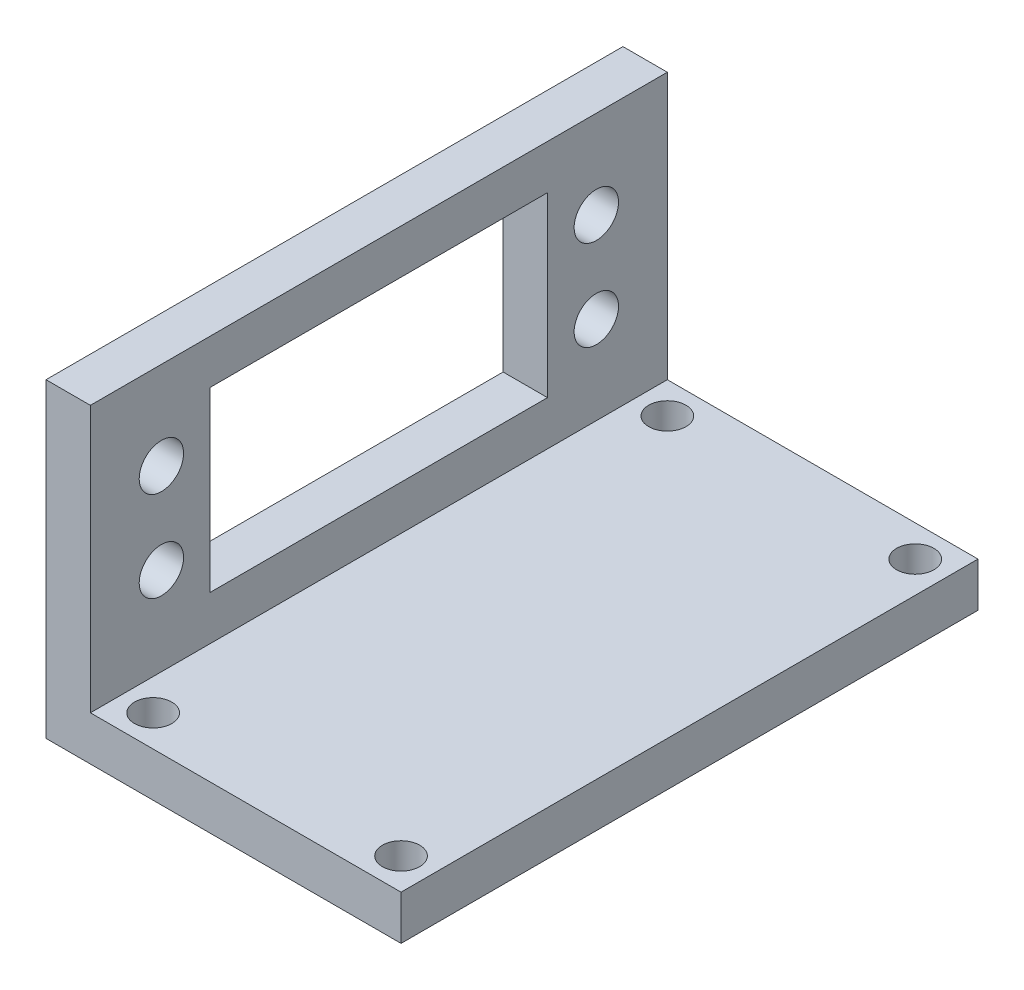
ISO-10303-21;
HEADER;
FILE_DESCRIPTION(('STEP AP214'),'2;1');
FILE_NAME('part.step','',(''),(''),'','','');
FILE_SCHEMA(('AUTOMOTIVE_DESIGN { 1 0 10303 214 1 1 1 1 }'));
ENDSEC;
DATA;
#1=APPLICATION_CONTEXT('core data for automotive mechanical design processes');
#2=APPLICATION_PROTOCOL_DEFINITION('international standard','automotive_design',2000,#1);
#3=PRODUCT_CONTEXT('',#1,'mechanical');
#4=PRODUCT('Part','Part','',(#3));
#5=PRODUCT_RELATED_PRODUCT_CATEGORY('part','',(#4));
#6=PRODUCT_DEFINITION_FORMATION('','',#4);
#7=PRODUCT_DEFINITION_CONTEXT('part definition',#1,'design');
#8=PRODUCT_DEFINITION('design','',#6,#7);
#9=PRODUCT_DEFINITION_SHAPE('','',#8);
#10=(LENGTH_UNIT() NAMED_UNIT(*) SI_UNIT(.MILLI.,.METRE.));
#11=(NAMED_UNIT(*) PLANE_ANGLE_UNIT() SI_UNIT($,.RADIAN.));
#12=(NAMED_UNIT(*) SI_UNIT($,.STERADIAN.) SOLID_ANGLE_UNIT());
#13=UNCERTAINTY_MEASURE_WITH_UNIT(LENGTH_MEASURE(1.E-05),#10,'distance_accuracy_value','');
#14=(GEOMETRIC_REPRESENTATION_CONTEXT(3) GLOBAL_UNCERTAINTY_ASSIGNED_CONTEXT((#13)) GLOBAL_UNIT_ASSIGNED_CONTEXT((#10,
#11,#12)) REPRESENTATION_CONTEXT('',''));
#15=CARTESIAN_POINT('',(0.,0.,0.));
#16=DIRECTION('',(0.,0.,1.));
#17=DIRECTION('',(1.,0.,0.));
#18=AXIS2_PLACEMENT_3D('',#15,#16,#17);
#19=CARTESIAN_POINT('',(40.,0.,65.));
#20=DIRECTION('',(0.,1.,0.));
#21=DIRECTION('',(-1.,0.,0.));
#22=AXIS2_PLACEMENT_3D('',#19,#20,#21);
#23=PLANE('',#22);
#24=CARTESIAN_POINT('',(8.53553390593272,0.,3.53553390593274));
#25=DIRECTION('',(0.,1.,0.));
#26=DIRECTION('',(1.,0.,0.));
#27=AXIS2_PLACEMENT_3D('',#24,#25,#26);
#28=CIRCLE('',#27,2.1);
#29=CARTESIAN_POINT('',(10.6355339059327,0.,3.53553390593274));
#30=VERTEX_POINT('',#29);
#31=EDGE_CURVE('E241',#30,#30,#28,.T.);
#32=ORIENTED_EDGE('',*,*,#31,.T.);
#33=EDGE_LOOP('',(#32));
#34=FACE_BOUND('',#33,.T.);
#35=CARTESIAN_POINT('',(36.4644660940673,0.,61.4644660940672));
#36=DIRECTION('',(0.,1.,0.));
#37=DIRECTION('',(1.,0.,0.));
#38=AXIS2_PLACEMENT_3D('',#35,#36,#37);
#39=CIRCLE('',#38,2.09999999999999);
#40=CARTESIAN_POINT('',(38.5644660940672,0.,61.4644660940672));
#41=VERTEX_POINT('',#40);
#42=EDGE_CURVE('E245',#41,#41,#39,.T.);
#43=ORIENTED_EDGE('',*,*,#42,.T.);
#44=EDGE_LOOP('',(#43));
#45=FACE_BOUND('',#44,.T.);
#46=CARTESIAN_POINT('',(8.53553390593273,0.,61.4644660940672));
#47=DIRECTION('',(0.,1.,0.));
#48=DIRECTION('',(-1.,0.,0.));
#49=AXIS2_PLACEMENT_3D('',#46,#47,#48);
#50=CIRCLE('',#49,2.09999999999999);
#51=CARTESIAN_POINT('',(6.43553390593274,0.,61.4644660940672));
#52=VERTEX_POINT('',#51);
#53=EDGE_CURVE('E249',#52,#52,#50,.T.);
#54=ORIENTED_EDGE('',*,*,#53,.T.);
#55=EDGE_LOOP('',(#54));
#56=FACE_BOUND('',#55,.T.);
#57=CARTESIAN_POINT('',(36.4644660940673,0.,3.53553390593274));
#58=DIRECTION('',(0.,1.,0.));
#59=DIRECTION('',(-1.,0.,0.));
#60=AXIS2_PLACEMENT_3D('',#57,#58,#59);
#61=CIRCLE('',#60,2.1);
#62=CARTESIAN_POINT('',(34.3644660940673,0.,3.53553390593274));
#63=VERTEX_POINT('',#62);
#64=EDGE_CURVE('E253',#63,#63,#61,.T.);
#65=ORIENTED_EDGE('',*,*,#64,.T.);
#66=EDGE_LOOP('',(#65));
#67=FACE_BOUND('',#66,.T.);
#68=DIRECTION('',(1.,0.,0.));
#69=VECTOR('',#68,1.);
#70=CARTESIAN_POINT('',(40.,0.,0.));
#71=LINE('',#70,#69);
#72=CARTESIAN_POINT('',(0.,0.,0.));
#73=VERTEX_POINT('',#72);
#74=CARTESIAN_POINT('',(40.,0.,0.));
#75=VERTEX_POINT('',#74);
#76=EDGE_CURVE('E176',#73,#75,#71,.T.);
#77=ORIENTED_EDGE('',*,*,#76,.T.);
#78=DIRECTION('',(0.,0.,-1.));
#79=VECTOR('',#78,1.);
#80=CARTESIAN_POINT('',(40.,0.,65.));
#81=LINE('',#80,#79);
#82=CARTESIAN_POINT('',(40.,0.,65.));
#83=VERTEX_POINT('',#82);
#84=EDGE_CURVE('E11',#83,#75,#81,.T.);
#85=ORIENTED_EDGE('',*,*,#84,.F.);
#86=DIRECTION('',(1.,0.,0.));
#87=VECTOR('',#86,1.);
#88=CARTESIAN_POINT('',(40.,0.,65.));
#89=LINE('',#88,#87);
#90=CARTESIAN_POINT('',(0.,0.,65.));
#91=VERTEX_POINT('',#90);
#92=EDGE_CURVE('E161',#91,#83,#89,.T.);
#93=ORIENTED_EDGE('',*,*,#92,.F.);
#94=DIRECTION('',(0.,0.,-1.));
#95=VECTOR('',#94,1.);
#96=CARTESIAN_POINT('',(0.,0.,65.));
#97=LINE('',#96,#95);
#98=EDGE_CURVE('E175',#91,#73,#97,.T.);
#99=ORIENTED_EDGE('',*,*,#98,.T.);
#100=EDGE_LOOP('',(#77,#85,#93,#99));
#101=FACE_BOUND('',#100,.T.);
#102=ADVANCED_FACE('F33',(#34,#45,#56,#67,#101),#23,.F.);
#103=CARTESIAN_POINT('',(40.,5.,65.));
#104=DIRECTION('',(-1.,0.,0.));
#105=DIRECTION('',(0.,-1.,0.));
#106=AXIS2_PLACEMENT_3D('',#103,#104,#105);
#107=PLANE('',#106);
#108=DIRECTION('',(0.,1.,0.));
#109=VECTOR('',#108,1.);
#110=CARTESIAN_POINT('',(40.,5.,0.));
#111=LINE('',#110,#109);
#112=CARTESIAN_POINT('',(40.,5.,0.));
#113=VERTEX_POINT('',#112);
#114=EDGE_CURVE('E179',#75,#113,#111,.T.);
#115=ORIENTED_EDGE('',*,*,#114,.T.);
#116=DIRECTION('',(0.,0.,-1.));
#117=VECTOR('',#116,1.);
#118=CARTESIAN_POINT('',(40.,5.,65.));
#119=LINE('',#118,#117);
#120=CARTESIAN_POINT('',(40.,5.,65.));
#121=VERTEX_POINT('',#120);
#122=EDGE_CURVE('E41',#121,#113,#119,.T.);
#123=ORIENTED_EDGE('',*,*,#122,.F.);
#124=DIRECTION('',(0.,1.,0.));
#125=VECTOR('',#124,1.);
#126=CARTESIAN_POINT('',(40.,5.,65.));
#127=LINE('',#126,#125);
#128=EDGE_CURVE('E164',#83,#121,#127,.T.);
#129=ORIENTED_EDGE('',*,*,#128,.F.);
#130=ORIENTED_EDGE('',*,*,#84,.T.);
#131=EDGE_LOOP('',(#115,#123,#129,#130));
#132=FACE_BOUND('',#131,.T.);
#133=ADVANCED_FACE('F229',(#132),#107,.F.);
#134=CARTESIAN_POINT('',(5.,5.,65.));
#135=DIRECTION('',(0.,-1.,0.));
#136=DIRECTION('',(1.,0.,0.));
#137=AXIS2_PLACEMENT_3D('',#134,#135,#136);
#138=PLANE('',#137);
#139=CARTESIAN_POINT('',(8.53553390593272,5.,3.53553390593274));
#140=DIRECTION('',(0.,1.,0.));
#141=DIRECTION('',(1.,0.,0.));
#142=AXIS2_PLACEMENT_3D('',#139,#140,#141);
#143=CIRCLE('',#142,2.1);
#144=CARTESIAN_POINT('',(10.6355339059327,5.,3.53553390593274));
#145=VERTEX_POINT('',#144);
#146=EDGE_CURVE('E350',#145,#145,#143,.T.);
#147=ORIENTED_EDGE('',*,*,#146,.F.);
#148=EDGE_LOOP('',(#147));
#149=FACE_BOUND('',#148,.T.);
#150=CARTESIAN_POINT('',(36.4644660940673,5.,61.4644660940672));
#151=DIRECTION('',(0.,1.,0.));
#152=DIRECTION('',(1.,0.,0.));
#153=AXIS2_PLACEMENT_3D('',#150,#151,#152);
#154=CIRCLE('',#153,2.09999999999999);
#155=CARTESIAN_POINT('',(38.5644660940672,5.,61.4644660940672));
#156=VERTEX_POINT('',#155);
#157=EDGE_CURVE('E345',#156,#156,#154,.T.);
#158=ORIENTED_EDGE('',*,*,#157,.F.);
#159=EDGE_LOOP('',(#158));
#160=FACE_BOUND('',#159,.T.);
#161=CARTESIAN_POINT('',(8.53553390593273,5.,61.4644660940672));
#162=DIRECTION('',(0.,1.,0.));
#163=DIRECTION('',(-1.,0.,0.));
#164=AXIS2_PLACEMENT_3D('',#161,#162,#163);
#165=CIRCLE('',#164,2.09999999999999);
#166=CARTESIAN_POINT('',(6.43553390593274,5.,61.4644660940672));
#167=VERTEX_POINT('',#166);
#168=EDGE_CURVE('E342',#167,#167,#165,.T.);
#169=ORIENTED_EDGE('',*,*,#168,.F.);
#170=EDGE_LOOP('',(#169));
#171=FACE_BOUND('',#170,.T.);
#172=CARTESIAN_POINT('',(36.4644660940673,5.,3.53553390593274));
#173=DIRECTION('',(0.,1.,0.));
#174=DIRECTION('',(-1.,0.,0.));
#175=AXIS2_PLACEMENT_3D('',#172,#173,#174);
#176=CIRCLE('',#175,2.1);
#177=CARTESIAN_POINT('',(34.3644660940673,5.,3.53553390593274));
#178=VERTEX_POINT('',#177);
#179=EDGE_CURVE('E349',#178,#178,#176,.T.);
#180=ORIENTED_EDGE('',*,*,#179,.F.);
#181=EDGE_LOOP('',(#180));
#182=FACE_BOUND('',#181,.T.);
#183=DIRECTION('',(-1.,0.,0.));
#184=VECTOR('',#183,1.);
#185=CARTESIAN_POINT('',(5.,5.,0.));
#186=LINE('',#185,#184);
#187=CARTESIAN_POINT('',(5.,5.,0.));
#188=VERTEX_POINT('',#187);
#189=EDGE_CURVE('E181',#113,#188,#186,.T.);
#190=ORIENTED_EDGE('',*,*,#189,.T.);
#191=DIRECTION('',(0.,0.,-1.));
#192=VECTOR('',#191,1.);
#193=CARTESIAN_POINT('',(5.,5.,65.));
#194=LINE('',#193,#192);
#195=CARTESIAN_POINT('',(5.,5.,65.));
#196=VERTEX_POINT('',#195);
#197=EDGE_CURVE('E196',#196,#188,#194,.T.);
#198=ORIENTED_EDGE('',*,*,#197,.F.);
#199=DIRECTION('',(-1.,0.,0.));
#200=VECTOR('',#199,1.);
#201=CARTESIAN_POINT('',(5.,5.,65.));
#202=LINE('',#201,#200);
#203=EDGE_CURVE('E167',#121,#196,#202,.T.);
#204=ORIENTED_EDGE('',*,*,#203,.F.);
#205=ORIENTED_EDGE('',*,*,#122,.T.);
#206=EDGE_LOOP('',(#190,#198,#204,#205));
#207=FACE_BOUND('',#206,.T.);
#208=ADVANCED_FACE('F236',(#149,#160,#171,#182,#207),#138,.F.);
#209=CARTESIAN_POINT('',(5.,35.,65.));
#210=DIRECTION('',(-1.,0.,0.));
#211=DIRECTION('',(0.,-1.,0.));
#212=AXIS2_PLACEMENT_3D('',#209,#210,#211);
#213=PLANE('',#212);
#214=DIRECTION('',(0.,0.,-1.));
#215=VECTOR('',#214,1.);
#216=CARTESIAN_POINT('',(5.,30.,65.));
#217=LINE('',#216,#215);
#218=CARTESIAN_POINT('',(5.,30.,51.5));
#219=VERTEX_POINT('',#218);
#220=CARTESIAN_POINT('',(5.,30.,13.5));
#221=VERTEX_POINT('',#220);
#222=EDGE_CURVE('E142',#219,#221,#217,.T.);
#223=ORIENTED_EDGE('',*,*,#222,.T.);
#224=DIRECTION('',(0.,-1.,0.));
#225=VECTOR('',#224,1.);
#226=CARTESIAN_POINT('',(5.,35.,13.5));
#227=LINE('',#226,#225);
#228=CARTESIAN_POINT('',(5.,9.99999999999999,13.5));
#229=VERTEX_POINT('',#228);
#230=EDGE_CURVE('E145',#221,#229,#227,.T.);
#231=ORIENTED_EDGE('',*,*,#230,.T.);
#232=DIRECTION('',(0.,0.,1.));
#233=VECTOR('',#232,1.);
#234=CARTESIAN_POINT('',(5.,9.99999999999999,65.));
#235=LINE('',#234,#233);
#236=CARTESIAN_POINT('',(5.,9.99999999999999,51.5));
#237=VERTEX_POINT('',#236);
#238=EDGE_CURVE('E137',#229,#237,#235,.T.);
#239=ORIENTED_EDGE('',*,*,#238,.T.);
#240=DIRECTION('',(0.,1.,0.));
#241=VECTOR('',#240,1.);
#242=CARTESIAN_POINT('',(5.,35.,51.5));
#243=LINE('',#242,#241);
#244=EDGE_CURVE('E117',#237,#219,#243,.T.);
#245=ORIENTED_EDGE('',*,*,#244,.T.);
#246=EDGE_LOOP('',(#223,#231,#239,#245));
#247=FACE_BOUND('',#246,.T.);
#248=CARTESIAN_POINT('',(5.,14.92,8.00000000000002));
#249=DIRECTION('',(1.,0.,0.));
#250=DIRECTION('',(0.,1.,0.));
#251=AXIS2_PLACEMENT_3D('',#248,#249,#250);
#252=CIRCLE('',#251,2.5);
#253=CARTESIAN_POINT('',(5.,17.42,8.00000000000002));
#254=VERTEX_POINT('',#253);
#255=EDGE_CURVE('E152',#254,#254,#252,.T.);
#256=ORIENTED_EDGE('',*,*,#255,.F.);
#257=EDGE_LOOP('',(#256));
#258=FACE_BOUND('',#257,.T.);
#259=CARTESIAN_POINT('',(5.,25.08,57.));
#260=DIRECTION('',(1.,0.,0.));
#261=DIRECTION('',(0.,1.,0.));
#262=AXIS2_PLACEMENT_3D('',#259,#260,#261);
#263=CIRCLE('',#262,2.5);
#264=CARTESIAN_POINT('',(5.,27.58,57.));
#265=VERTEX_POINT('',#264);
#266=EDGE_CURVE('E151',#265,#265,#263,.T.);
#267=ORIENTED_EDGE('',*,*,#266,.F.);
#268=EDGE_LOOP('',(#267));
#269=FACE_BOUND('',#268,.T.);
#270=CARTESIAN_POINT('',(5.,14.92,57.));
#271=DIRECTION('',(1.,0.,0.));
#272=DIRECTION('',(0.,1.,0.));
#273=AXIS2_PLACEMENT_3D('',#270,#271,#272);
#274=CIRCLE('',#273,2.5);
#275=CARTESIAN_POINT('',(5.,17.42,57.));
#276=VERTEX_POINT('',#275);
#277=EDGE_CURVE('E148',#276,#276,#274,.T.);
#278=ORIENTED_EDGE('',*,*,#277,.F.);
#279=EDGE_LOOP('',(#278));
#280=FACE_BOUND('',#279,.T.);
#281=CARTESIAN_POINT('',(5.,25.08,8.00000000000002));
#282=DIRECTION('',(1.,0.,0.));
#283=DIRECTION('',(0.,1.,0.));
#284=AXIS2_PLACEMENT_3D('',#281,#282,#283);
#285=CIRCLE('',#284,2.5);
#286=CARTESIAN_POINT('',(5.,27.58,8.00000000000002));
#287=VERTEX_POINT('',#286);
#288=EDGE_CURVE('E155',#287,#287,#285,.T.);
#289=ORIENTED_EDGE('',*,*,#288,.F.);
#290=EDGE_LOOP('',(#289));
#291=FACE_BOUND('',#290,.T.);
#292=DIRECTION('',(0.,1.,0.));
#293=VECTOR('',#292,1.);
#294=CARTESIAN_POINT('',(5.,35.,0.));
#295=LINE('',#294,#293);
#296=CARTESIAN_POINT('',(5.,35.,0.));
#297=VERTEX_POINT('',#296);
#298=EDGE_CURVE('E183',#188,#297,#295,.T.);
#299=ORIENTED_EDGE('',*,*,#298,.T.);
#300=DIRECTION('',(0.,0.,-1.));
#301=VECTOR('',#300,1.);
#302=CARTESIAN_POINT('',(5.,35.,65.));
#303=LINE('',#302,#301);
#304=CARTESIAN_POINT('',(5.,35.,65.));
#305=VERTEX_POINT('',#304);
#306=EDGE_CURVE('E193',#305,#297,#303,.T.);
#307=ORIENTED_EDGE('',*,*,#306,.F.);
#308=DIRECTION('',(0.,1.,0.));
#309=VECTOR('',#308,1.);
#310=CARTESIAN_POINT('',(5.,35.,65.));
#311=LINE('',#310,#309);
#312=EDGE_CURVE('E169',#196,#305,#311,.T.);
#313=ORIENTED_EDGE('',*,*,#312,.F.);
#314=ORIENTED_EDGE('',*,*,#197,.T.);
#315=EDGE_LOOP('',(#299,#307,#313,#314));
#316=FACE_BOUND('',#315,.T.);
#317=ADVANCED_FACE('F276',(#247,#258,#269,#280,#291,#316),#213,.F.);
#318=CARTESIAN_POINT('',(0.,35.,65.));
#319=DIRECTION('',(0.,-1.,0.));
#320=DIRECTION('',(0.,0.,-1.));
#321=AXIS2_PLACEMENT_3D('',#318,#319,#320);
#322=PLANE('',#321);
#323=DIRECTION('',(-1.,0.,0.));
#324=VECTOR('',#323,1.);
#325=CARTESIAN_POINT('',(0.,35.,0.));
#326=LINE('',#325,#324);
#327=CARTESIAN_POINT('',(0.,35.,0.));
#328=VERTEX_POINT('',#327);
#329=EDGE_CURVE('E185',#297,#328,#326,.T.);
#330=ORIENTED_EDGE('',*,*,#329,.T.);
#331=DIRECTION('',(0.,0.,-1.));
#332=VECTOR('',#331,1.);
#333=CARTESIAN_POINT('',(0.,35.,65.));
#334=LINE('',#333,#332);
#335=CARTESIAN_POINT('',(0.,35.,65.));
#336=VERTEX_POINT('',#335);
#337=EDGE_CURVE('E190',#336,#328,#334,.T.);
#338=ORIENTED_EDGE('',*,*,#337,.F.);
#339=DIRECTION('',(-1.,0.,0.));
#340=VECTOR('',#339,1.);
#341=CARTESIAN_POINT('',(0.,35.,65.));
#342=LINE('',#341,#340);
#343=EDGE_CURVE('E171',#305,#336,#342,.T.);
#344=ORIENTED_EDGE('',*,*,#343,.F.);
#345=ORIENTED_EDGE('',*,*,#306,.T.);
#346=EDGE_LOOP('',(#330,#338,#344,#345));
#347=FACE_BOUND('',#346,.T.);
#348=ADVANCED_FACE('F273',(#347),#322,.F.);
#349=CARTESIAN_POINT('',(0.,0.,65.));
#350=DIRECTION('',(1.,0.,0.));
#351=DIRECTION('',(0.,0.,-1.));
#352=AXIS2_PLACEMENT_3D('',#349,#350,#351);
#353=PLANE('',#352);
#354=DIRECTION('',(0.,0.,1.));
#355=VECTOR('',#354,1.);
#356=CARTESIAN_POINT('',(0.,9.99999999999999,51.5));
#357=LINE('',#356,#355);
#358=CARTESIAN_POINT('',(0.,9.99999999999999,13.5));
#359=VERTEX_POINT('',#358);
#360=CARTESIAN_POINT('',(0.,9.99999999999999,51.5));
#361=VERTEX_POINT('',#360);
#362=EDGE_CURVE('E123',#359,#361,#357,.T.);
#363=ORIENTED_EDGE('',*,*,#362,.F.);
#364=DIRECTION('',(0.,-1.,0.));
#365=VECTOR('',#364,1.);
#366=CARTESIAN_POINT('',(0.,30.,13.5));
#367=LINE('',#366,#365);
#368=CARTESIAN_POINT('',(0.,30.,13.5));
#369=VERTEX_POINT('',#368);
#370=EDGE_CURVE('E57',#369,#359,#367,.T.);
#371=ORIENTED_EDGE('',*,*,#370,.F.);
#372=DIRECTION('',(0.,0.,-1.));
#373=VECTOR('',#372,1.);
#374=CARTESIAN_POINT('',(0.,30.,51.5));
#375=LINE('',#374,#373);
#376=CARTESIAN_POINT('',(0.,30.,51.5));
#377=VERTEX_POINT('',#376);
#378=EDGE_CURVE('E130',#377,#369,#375,.T.);
#379=ORIENTED_EDGE('',*,*,#378,.F.);
#380=DIRECTION('',(0.,1.,0.));
#381=VECTOR('',#380,1.);
#382=CARTESIAN_POINT('',(0.,30.,51.5));
#383=LINE('',#382,#381);
#384=EDGE_CURVE('E114',#361,#377,#383,.T.);
#385=ORIENTED_EDGE('',*,*,#384,.F.);
#386=EDGE_LOOP('',(#363,#371,#379,#385));
#387=FACE_BOUND('',#386,.T.);
#388=CARTESIAN_POINT('',(0.,14.92,8.00000000000002));
#389=DIRECTION('',(1.,0.,0.));
#390=DIRECTION('',(0.,0.,-1.));
#391=AXIS2_PLACEMENT_3D('',#388,#389,#390);
#392=CIRCLE('',#391,2.5);
#393=CARTESIAN_POINT('',(0.,14.92,5.50000000000002));
#394=VERTEX_POINT('',#393);
#395=EDGE_CURVE('E36',#394,#394,#392,.T.);
#396=ORIENTED_EDGE('',*,*,#395,.T.);
#397=EDGE_LOOP('',(#396));
#398=FACE_BOUND('',#397,.T.);
#399=CARTESIAN_POINT('',(0.,25.08,57.));
#400=DIRECTION('',(1.,0.,0.));
#401=DIRECTION('',(0.,0.,-1.));
#402=AXIS2_PLACEMENT_3D('',#399,#400,#401);
#403=CIRCLE('',#402,2.5);
#404=CARTESIAN_POINT('',(0.,25.08,54.5));
#405=VERTEX_POINT('',#404);
#406=EDGE_CURVE('E205',#405,#405,#403,.T.);
#407=ORIENTED_EDGE('',*,*,#406,.T.);
#408=EDGE_LOOP('',(#407));
#409=FACE_BOUND('',#408,.T.);
#410=CARTESIAN_POINT('',(0.,14.92,57.));
#411=DIRECTION('',(1.,0.,0.));
#412=DIRECTION('',(0.,0.,-1.));
#413=AXIS2_PLACEMENT_3D('',#410,#411,#412);
#414=CIRCLE('',#413,2.5);
#415=CARTESIAN_POINT('',(0.,14.92,54.5));
#416=VERTEX_POINT('',#415);
#417=EDGE_CURVE('E203',#416,#416,#414,.T.);
#418=ORIENTED_EDGE('',*,*,#417,.T.);
#419=EDGE_LOOP('',(#418));
#420=FACE_BOUND('',#419,.T.);
#421=CARTESIAN_POINT('',(0.,25.08,8.00000000000002));
#422=DIRECTION('',(1.,0.,0.));
#423=DIRECTION('',(0.,0.,-1.));
#424=AXIS2_PLACEMENT_3D('',#421,#422,#423);
#425=CIRCLE('',#424,2.5);
#426=CARTESIAN_POINT('',(0.,25.08,5.50000000000003));
#427=VERTEX_POINT('',#426);
#428=EDGE_CURVE('E160',#427,#427,#425,.T.);
#429=ORIENTED_EDGE('',*,*,#428,.T.);
#430=EDGE_LOOP('',(#429));
#431=FACE_BOUND('',#430,.T.);
#432=DIRECTION('',(0.,-1.,0.));
#433=VECTOR('',#432,1.);
#434=CARTESIAN_POINT('',(0.,0.,0.));
#435=LINE('',#434,#433);
#436=EDGE_CURVE('E165',#328,#73,#435,.T.);
#437=ORIENTED_EDGE('',*,*,#436,.T.);
#438=ORIENTED_EDGE('',*,*,#98,.F.);
#439=DIRECTION('',(0.,-1.,0.));
#440=VECTOR('',#439,1.);
#441=CARTESIAN_POINT('',(0.,0.,65.));
#442=LINE('',#441,#440);
#443=EDGE_CURVE('E173',#336,#91,#442,.T.);
#444=ORIENTED_EDGE('',*,*,#443,.F.);
#445=ORIENTED_EDGE('',*,*,#337,.T.);
#446=EDGE_LOOP('',(#437,#438,#444,#445));
#447=FACE_BOUND('',#446,.T.);
#448=ADVANCED_FACE('F127',(#387,#398,#409,#420,#431,#447),#353,.F.);
#449=CARTESIAN_POINT('',(0.,0.,65.));
#450=DIRECTION('',(0.,0.,-1.));
#451=DIRECTION('',(-1.,0.,0.));
#452=AXIS2_PLACEMENT_3D('',#449,#450,#451);
#453=PLANE('',#452);
#454=ORIENTED_EDGE('',*,*,#92,.T.);
#455=ORIENTED_EDGE('',*,*,#128,.T.);
#456=ORIENTED_EDGE('',*,*,#203,.T.);
#457=ORIENTED_EDGE('',*,*,#312,.T.);
#458=ORIENTED_EDGE('',*,*,#343,.T.);
#459=ORIENTED_EDGE('',*,*,#443,.T.);
#460=EDGE_LOOP('',(#454,#455,#456,#457,#458,#459));
#461=FACE_BOUND('',#460,.T.);
#462=ADVANCED_FACE('F267',(#461),#453,.F.);
#463=CARTESIAN_POINT('',(0.,0.,0.));
#464=DIRECTION('',(0.,0.,-1.));
#465=DIRECTION('',(-1.,0.,0.));
#466=AXIS2_PLACEMENT_3D('',#463,#464,#465);
#467=PLANE('',#466);
#468=ORIENTED_EDGE('',*,*,#76,.F.);
#469=ORIENTED_EDGE('',*,*,#436,.F.);
#470=ORIENTED_EDGE('',*,*,#329,.F.);
#471=ORIENTED_EDGE('',*,*,#298,.F.);
#472=ORIENTED_EDGE('',*,*,#189,.F.);
#473=ORIENTED_EDGE('',*,*,#114,.F.);
#474=EDGE_LOOP('',(#468,#469,#470,#471,#472,#473));
#475=FACE_BOUND('',#474,.T.);
#476=ADVANCED_FACE('F260',(#475),#467,.T.);
#477=CARTESIAN_POINT('',(-5.,25.08,8.00000000000002));
#478=DIRECTION('',(1.,0.,0.));
#479=DIRECTION('',(0.,1.,0.));
#480=AXIS2_PLACEMENT_3D('',#477,#478,#479);
#481=CYLINDRICAL_SURFACE('',#480,2.5);
#482=ORIENTED_EDGE('',*,*,#288,.T.);
#483=EDGE_LOOP('',(#482));
#484=FACE_BOUND('',#483,.T.);
#485=ORIENTED_EDGE('',*,*,#428,.F.);
#486=EDGE_LOOP('',(#485));
#487=FACE_BOUND('',#486,.T.);
#488=ADVANCED_FACE('F297',(#484,#487),#481,.F.);
#489=CARTESIAN_POINT('',(-5.,14.92,57.));
#490=DIRECTION('',(1.,0.,0.));
#491=DIRECTION('',(0.,1.,0.));
#492=AXIS2_PLACEMENT_3D('',#489,#490,#491);
#493=CYLINDRICAL_SURFACE('',#492,2.5);
#494=ORIENTED_EDGE('',*,*,#277,.T.);
#495=EDGE_LOOP('',(#494));
#496=FACE_BOUND('',#495,.T.);
#497=ORIENTED_EDGE('',*,*,#417,.F.);
#498=EDGE_LOOP('',(#497));
#499=FACE_BOUND('',#498,.T.);
#500=ADVANCED_FACE('F224',(#496,#499),#493,.F.);
#501=CARTESIAN_POINT('',(-5.,25.08,57.));
#502=DIRECTION('',(1.,0.,0.));
#503=DIRECTION('',(0.,1.,0.));
#504=AXIS2_PLACEMENT_3D('',#501,#502,#503);
#505=CYLINDRICAL_SURFACE('',#504,2.5);
#506=ORIENTED_EDGE('',*,*,#266,.T.);
#507=EDGE_LOOP('',(#506));
#508=FACE_BOUND('',#507,.T.);
#509=ORIENTED_EDGE('',*,*,#406,.F.);
#510=EDGE_LOOP('',(#509));
#511=FACE_BOUND('',#510,.T.);
#512=ADVANCED_FACE('F215',(#508,#511),#505,.F.);
#513=CARTESIAN_POINT('',(-5.,14.92,8.00000000000002));
#514=DIRECTION('',(1.,0.,0.));
#515=DIRECTION('',(0.,1.,0.));
#516=AXIS2_PLACEMENT_3D('',#513,#514,#515);
#517=CYLINDRICAL_SURFACE('',#516,2.5);
#518=ORIENTED_EDGE('',*,*,#255,.T.);
#519=EDGE_LOOP('',(#518));
#520=FACE_BOUND('',#519,.T.);
#521=ORIENTED_EDGE('',*,*,#395,.F.);
#522=EDGE_LOOP('',(#521));
#523=FACE_BOUND('',#522,.T.);
#524=ADVANCED_FACE('F212',(#520,#523),#517,.F.);
#525=CARTESIAN_POINT('',(10.,30.,13.5));
#526=DIRECTION('',(0.,0.,-1.));
#527=DIRECTION('',(-1.,0.,0.));
#528=AXIS2_PLACEMENT_3D('',#525,#526,#527);
#529=PLANE('',#528);
#530=DIRECTION('',(-1.,0.,0.));
#531=VECTOR('',#530,1.);
#532=CARTESIAN_POINT('',(10.,30.,13.5));
#533=LINE('',#532,#531);
#534=EDGE_CURVE('E135',#221,#369,#533,.T.);
#535=ORIENTED_EDGE('',*,*,#534,.T.);
#536=ORIENTED_EDGE('',*,*,#370,.T.);
#537=DIRECTION('',(-1.,0.,0.));
#538=VECTOR('',#537,1.);
#539=CARTESIAN_POINT('',(10.,9.99999999999999,13.5));
#540=LINE('',#539,#538);
#541=EDGE_CURVE('E120',#229,#359,#540,.T.);
#542=ORIENTED_EDGE('',*,*,#541,.F.);
#543=ORIENTED_EDGE('',*,*,#230,.F.);
#544=EDGE_LOOP('',(#535,#536,#542,#543));
#545=FACE_BOUND('',#544,.T.);
#546=ADVANCED_FACE('F214',(#545),#529,.F.);
#547=CARTESIAN_POINT('',(10.,30.,51.5));
#548=DIRECTION('',(0.,1.,0.));
#549=DIRECTION('',(0.,0.,1.));
#550=AXIS2_PLACEMENT_3D('',#547,#548,#549);
#551=PLANE('',#550);
#552=DIRECTION('',(-1.,0.,0.));
#553=VECTOR('',#552,1.);
#554=CARTESIAN_POINT('',(10.,30.,51.5));
#555=LINE('',#554,#553);
#556=EDGE_CURVE('E119',#219,#377,#555,.T.);
#557=ORIENTED_EDGE('',*,*,#556,.T.);
#558=ORIENTED_EDGE('',*,*,#378,.T.);
#559=ORIENTED_EDGE('',*,*,#534,.F.);
#560=ORIENTED_EDGE('',*,*,#222,.F.);
#561=EDGE_LOOP('',(#557,#558,#559,#560));
#562=FACE_BOUND('',#561,.T.);
#563=ADVANCED_FACE('F222',(#562),#551,.F.);
#564=CARTESIAN_POINT('',(10.,30.,51.5));
#565=DIRECTION('',(0.,0.,1.));
#566=DIRECTION('',(1.,0.,0.));
#567=AXIS2_PLACEMENT_3D('',#564,#565,#566);
#568=PLANE('',#567);
#569=DIRECTION('',(-1.,0.,0.));
#570=VECTOR('',#569,1.);
#571=CARTESIAN_POINT('',(10.,9.99999999999999,51.5));
#572=LINE('',#571,#570);
#573=EDGE_CURVE('E49',#237,#361,#572,.T.);
#574=ORIENTED_EDGE('',*,*,#573,.T.);
#575=ORIENTED_EDGE('',*,*,#384,.T.);
#576=ORIENTED_EDGE('',*,*,#556,.F.);
#577=ORIENTED_EDGE('',*,*,#244,.F.);
#578=EDGE_LOOP('',(#574,#575,#576,#577));
#579=FACE_BOUND('',#578,.T.);
#580=ADVANCED_FACE('F111',(#579),#568,.F.);
#581=CARTESIAN_POINT('',(10.,9.99999999999999,51.5));
#582=DIRECTION('',(0.,-1.,0.));
#583=DIRECTION('',(0.,0.,-1.));
#584=AXIS2_PLACEMENT_3D('',#581,#582,#583);
#585=PLANE('',#584);
#586=ORIENTED_EDGE('',*,*,#541,.T.);
#587=ORIENTED_EDGE('',*,*,#362,.T.);
#588=ORIENTED_EDGE('',*,*,#573,.F.);
#589=ORIENTED_EDGE('',*,*,#238,.F.);
#590=EDGE_LOOP('',(#586,#587,#588,#589));
#591=FACE_BOUND('',#590,.T.);
#592=ADVANCED_FACE('F124',(#591),#585,.F.);
#593=CARTESIAN_POINT('',(36.4644660940673,0.,3.53553390593274));
#594=DIRECTION('',(0.,1.,0.));
#595=DIRECTION('',(-1.,0.,0.));
#596=AXIS2_PLACEMENT_3D('',#593,#594,#595);
#597=CYLINDRICAL_SURFACE('',#596,2.1);
#598=ORIENTED_EDGE('',*,*,#64,.F.);
#599=EDGE_LOOP('',(#598));
#600=FACE_BOUND('',#599,.T.);
#601=ORIENTED_EDGE('',*,*,#179,.T.);
#602=EDGE_LOOP('',(#601));
#603=FACE_BOUND('',#602,.T.);
#604=ADVANCED_FACE('F317',(#600,#603),#597,.F.);
#605=CARTESIAN_POINT('',(8.53553390593273,0.,61.4644660940672));
#606=DIRECTION('',(0.,1.,0.));
#607=DIRECTION('',(-1.,0.,0.));
#608=AXIS2_PLACEMENT_3D('',#605,#606,#607);
#609=CYLINDRICAL_SURFACE('',#608,2.09999999999999);
#610=ORIENTED_EDGE('',*,*,#53,.F.);
#611=EDGE_LOOP('',(#610));
#612=FACE_BOUND('',#611,.T.);
#613=ORIENTED_EDGE('',*,*,#168,.T.);
#614=EDGE_LOOP('',(#613));
#615=FACE_BOUND('',#614,.T.);
#616=ADVANCED_FACE('F325',(#612,#615),#609,.F.);
#617=CARTESIAN_POINT('',(36.4644660940673,0.,61.4644660940672));
#618=DIRECTION('',(0.,1.,0.));
#619=DIRECTION('',(-1.,0.,0.));
#620=AXIS2_PLACEMENT_3D('',#617,#618,#619);
#621=CYLINDRICAL_SURFACE('',#620,2.09999999999999);
#622=ORIENTED_EDGE('',*,*,#42,.F.);
#623=EDGE_LOOP('',(#622));
#624=FACE_BOUND('',#623,.T.);
#625=ORIENTED_EDGE('',*,*,#157,.T.);
#626=EDGE_LOOP('',(#625));
#627=FACE_BOUND('',#626,.T.);
#628=ADVANCED_FACE('F327',(#624,#627),#621,.F.);
#629=CARTESIAN_POINT('',(8.53553390593272,0.,3.53553390593274));
#630=DIRECTION('',(0.,1.,0.));
#631=DIRECTION('',(-1.,0.,0.));
#632=AXIS2_PLACEMENT_3D('',#629,#630,#631);
#633=CYLINDRICAL_SURFACE('',#632,2.1);
#634=ORIENTED_EDGE('',*,*,#31,.F.);
#635=EDGE_LOOP('',(#634));
#636=FACE_BOUND('',#635,.T.);
#637=ORIENTED_EDGE('',*,*,#146,.T.);
#638=EDGE_LOOP('',(#637));
#639=FACE_BOUND('',#638,.T.);
#640=ADVANCED_FACE('F330',(#636,#639),#633,.F.);
#641=CLOSED_SHELL('',(#102,#133,#208,#317,#348,#448,#462,#476,#488,#500,#512,#524,#546,#563,
#580,#592,#604,#616,#628,#640));
#642=MANIFOLD_SOLID_BREP('B2',#641);
#643=ADVANCED_BREP_SHAPE_REPRESENTATION('',(#18,#642),#14);
#644=SHAPE_DEFINITION_REPRESENTATION(#9,#643);
ENDSEC;
END-ISO-10303-21;
